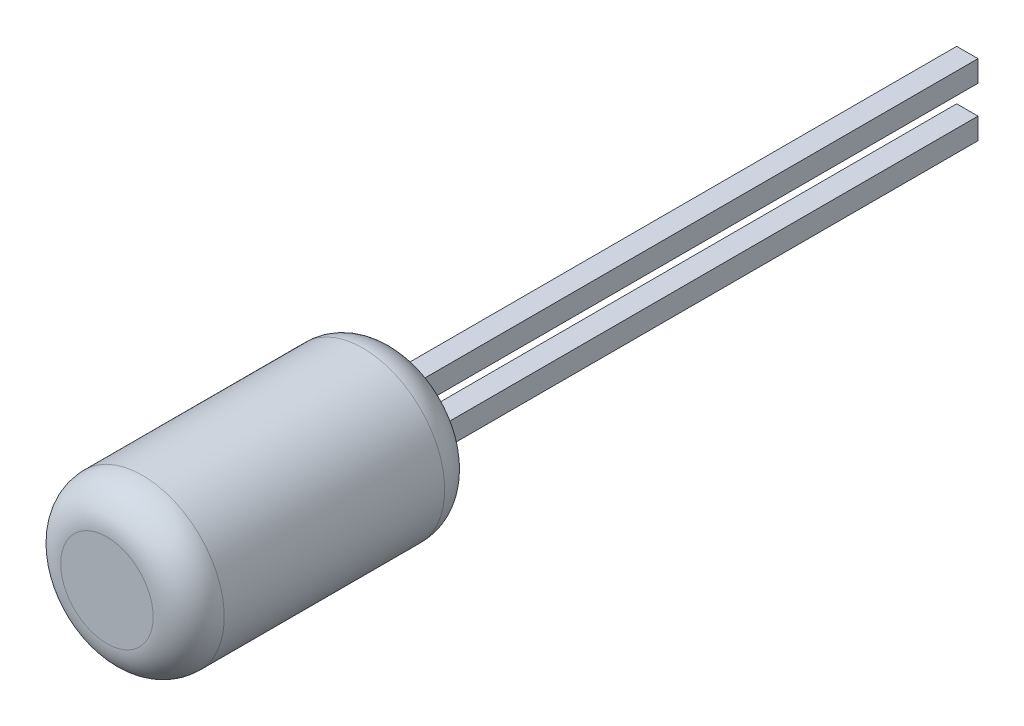
ISO-10303-21;
HEADER;
FILE_DESCRIPTION(('STEP AP214'),'2;1');
FILE_NAME('part.step','',(''),(''),'','','');
FILE_SCHEMA(('AUTOMOTIVE_DESIGN { 1 0 10303 214 1 1 1 1 }'));
ENDSEC;
DATA;
#1=APPLICATION_CONTEXT('core data for automotive mechanical design processes');
#2=APPLICATION_PROTOCOL_DEFINITION('international standard','automotive_design',2000,#1);
#3=PRODUCT_CONTEXT('',#1,'mechanical');
#4=PRODUCT('Part','Part','',(#3));
#5=PRODUCT_RELATED_PRODUCT_CATEGORY('part','',(#4));
#6=PRODUCT_DEFINITION_FORMATION('','',#4);
#7=PRODUCT_DEFINITION_CONTEXT('part definition',#1,'design');
#8=PRODUCT_DEFINITION('design','',#6,#7);
#9=PRODUCT_DEFINITION_SHAPE('','',#8);
#10=(LENGTH_UNIT() NAMED_UNIT(*) SI_UNIT(.MILLI.,.METRE.));
#11=(NAMED_UNIT(*) PLANE_ANGLE_UNIT() SI_UNIT($,.RADIAN.));
#12=(NAMED_UNIT(*) SI_UNIT($,.STERADIAN.) SOLID_ANGLE_UNIT());
#13=UNCERTAINTY_MEASURE_WITH_UNIT(LENGTH_MEASURE(1.E-05),#10,'distance_accuracy_value','');
#14=(GEOMETRIC_REPRESENTATION_CONTEXT(3) GLOBAL_UNCERTAINTY_ASSIGNED_CONTEXT((#13)) GLOBAL_UNIT_ASSIGNED_CONTEXT((#10,
#11,#12)) REPRESENTATION_CONTEXT('',''));
#15=CARTESIAN_POINT('',(0.,0.,0.));
#16=DIRECTION('',(0.,0.,1.));
#17=DIRECTION('',(1.,0.,0.));
#18=AXIS2_PLACEMENT_3D('',#15,#16,#17);
#19=CARTESIAN_POINT('',(0.,0.,0.));
#20=DIRECTION('',(0.,0.,1.));
#21=DIRECTION('',(1.,0.,0.));
#22=AXIS2_PLACEMENT_3D('',#19,#20,#21);
#23=PLANE('',#22);
#24=CARTESIAN_POINT('',(0.,0.,0.));
#25=DIRECTION('',(0.,0.,-1.));
#26=DIRECTION('',(-1.,0.,0.));
#27=AXIS2_PLACEMENT_3D('',#24,#25,#26);
#28=CIRCLE('',#27,0.65);
#29=CARTESIAN_POINT('',(-0.65,0.,0.));
#30=VERTEX_POINT('',#29);
#31=CARTESIAN_POINT('',(0.65,0.,0.));
#32=VERTEX_POINT('',#31);
#33=EDGE_CURVE('P0_E49',#30,#32,#28,.T.);
#34=ORIENTED_EDGE('',*,*,#33,.F.);
#35=CARTESIAN_POINT('',(0.,0.,0.));
#36=DIRECTION('',(0.,0.,-1.));
#37=DIRECTION('',(1.,0.,0.));
#38=AXIS2_PLACEMENT_3D('',#35,#36,#37);
#39=CIRCLE('',#38,0.65);
#40=EDGE_CURVE('P0_E45',#32,#30,#39,.T.);
#41=ORIENTED_EDGE('',*,*,#40,.F.);
#42=EDGE_LOOP('',(#34,#41));
#43=FACE_BOUND('',#42,.T.);
#44=ADVANCED_FACE('P0_F16',(#43),#23,.T.);
#45=CARTESIAN_POINT('',(0.,0.,-4.1));
#46=DIRECTION('',(0.,0.,-1.));
#47=DIRECTION('',(-1.,0.,0.));
#48=AXIS2_PLACEMENT_3D('',#45,#46,#47);
#49=PLANE('',#48);
#50=CARTESIAN_POINT('',(0.,0.,-4.1));
#51=DIRECTION('',(0.,0.,1.));
#52=DIRECTION('',(1.,0.,0.));
#53=AXIS2_PLACEMENT_3D('',#50,#51,#52);
#54=CIRCLE('',#53,0.65);
#55=CARTESIAN_POINT('',(0.65,0.,-4.1));
#56=VERTEX_POINT('',#55);
#57=CARTESIAN_POINT('',(-0.65,0.,-4.1));
#58=VERTEX_POINT('',#57);
#59=EDGE_CURVE('P0_E56',#56,#58,#54,.T.);
#60=ORIENTED_EDGE('',*,*,#59,.F.);
#61=CARTESIAN_POINT('',(0.,0.,-4.1));
#62=DIRECTION('',(0.,0.,1.));
#63=DIRECTION('',(-1.,0.,0.));
#64=AXIS2_PLACEMENT_3D('',#61,#62,#63);
#65=CIRCLE('',#64,0.65);
#66=EDGE_CURVE('P0_E36',#58,#56,#65,.T.);
#67=ORIENTED_EDGE('',*,*,#66,.F.);
#68=EDGE_LOOP('',(#60,#67));
#69=FACE_BOUND('',#68,.T.);
#70=ADVANCED_FACE('P0_F74',(#69),#49,.T.);
#71=CARTESIAN_POINT('',(0.,0.,-0.5));
#72=DIRECTION('',(0.,0.,1.));
#73=DIRECTION('',(1.,0.,0.));
#74=AXIS2_PLACEMENT_3D('',#71,#72,#73);
#75=TOROIDAL_SURFACE('',#74,0.65,0.5);
#76=ORIENTED_EDGE('',*,*,#40,.T.);
#77=ORIENTED_EDGE('',*,*,#33,.T.);
#78=EDGE_LOOP('',(#76,#77));
#79=FACE_BOUND('',#78,.T.);
#80=CARTESIAN_POINT('',(0.,0.,-0.5));
#81=DIRECTION('',(0.,0.,-1.));
#82=DIRECTION('',(-1.,0.,0.));
#83=AXIS2_PLACEMENT_3D('',#80,#81,#82);
#84=CIRCLE('',#83,1.15);
#85=CARTESIAN_POINT('',(-1.15,0.,-0.5));
#86=VERTEX_POINT('',#85);
#87=EDGE_CURVE('P0_E28',#86,#86,#84,.T.);
#88=ORIENTED_EDGE('',*,*,#87,.F.);
#89=EDGE_LOOP('',(#88));
#90=FACE_BOUND('',#89,.T.);
#91=ADVANCED_FACE('P0_F54',(#79,#90),#75,.T.);
#92=CARTESIAN_POINT('',(0.,0.,-3.6));
#93=DIRECTION('',(0.,0.,-1.));
#94=DIRECTION('',(-1.,0.,0.));
#95=AXIS2_PLACEMENT_3D('',#92,#93,#94);
#96=TOROIDAL_SURFACE('',#95,0.65,0.5);
#97=ORIENTED_EDGE('',*,*,#66,.T.);
#98=ORIENTED_EDGE('',*,*,#59,.T.);
#99=EDGE_LOOP('',(#97,#98));
#100=FACE_BOUND('',#99,.T.);
#101=CARTESIAN_POINT('',(0.,0.,-3.6));
#102=DIRECTION('',(0.,0.,-1.));
#103=DIRECTION('',(-1.,0.,0.));
#104=AXIS2_PLACEMENT_3D('',#101,#102,#103);
#105=CIRCLE('',#104,1.15);
#106=CARTESIAN_POINT('',(-1.15,0.,-3.6));
#107=VERTEX_POINT('',#106);
#108=EDGE_CURVE('P0_E11',#107,#107,#105,.F.);
#109=ORIENTED_EDGE('',*,*,#108,.F.);
#110=EDGE_LOOP('',(#109));
#111=FACE_BOUND('',#110,.T.);
#112=ADVANCED_FACE('P0_F73',(#100,#111),#96,.T.);
#113=CARTESIAN_POINT('',(0.,0.,0.));
#114=DIRECTION('',(0.,0.,-1.));
#115=DIRECTION('',(-1.,0.,0.));
#116=AXIS2_PLACEMENT_3D('',#113,#114,#115);
#117=CYLINDRICAL_SURFACE('',#116,1.15);
#118=ORIENTED_EDGE('',*,*,#108,.T.);
#119=EDGE_LOOP('',(#118));
#120=FACE_BOUND('',#119,.T.);
#121=ORIENTED_EDGE('',*,*,#87,.T.);
#122=EDGE_LOOP('',(#121));
#123=FACE_BOUND('',#122,.T.);
#124=ADVANCED_FACE('P0_F120',(#120,#123),#117,.T.);
#125=CLOSED_SHELL('',(#44,#70,#91,#112,#124));
#126=MANIFOLD_SOLID_BREP('P0_B1',#125);
#127=CARTESIAN_POINT('',(-0.15,-0.5,-3.1));
#128=DIRECTION('',(-1.,0.,0.));
#129=DIRECTION('',(0.,-1.,0.));
#130=AXIS2_PLACEMENT_3D('',#127,#128,#129);
#131=PLANE('',#130);
#132=DIRECTION('',(0.,0.,-1.));
#133=VECTOR('',#132,1.);
#134=CARTESIAN_POINT('',(-0.15,-0.5,-3.1));
#135=LINE('',#134,#133);
#136=CARTESIAN_POINT('',(-0.15,-0.5,-3.1));
#137=VERTEX_POINT('',#136);
#138=CARTESIAN_POINT('',(-0.15,-0.5,-12.1));
#139=VERTEX_POINT('',#138);
#140=EDGE_CURVE('P1_E60',#137,#139,#135,.T.);
#141=ORIENTED_EDGE('',*,*,#140,.F.);
#142=DIRECTION('',(0.,-1.,0.));
#143=VECTOR('',#142,1.);
#144=CARTESIAN_POINT('',(-0.15,-0.5,-3.1));
#145=LINE('',#144,#143);
#146=CARTESIAN_POINT('',(-0.15,-0.2,-3.1));
#147=VERTEX_POINT('',#146);
#148=EDGE_CURVE('P1_E19',#137,#147,#145,.F.);
#149=ORIENTED_EDGE('',*,*,#148,.T.);
#150=DIRECTION('',(0.,0.,1.));
#151=VECTOR('',#150,1.);
#152=CARTESIAN_POINT('',(-0.15,-0.2,-3.1));
#153=LINE('',#152,#151);
#154=CARTESIAN_POINT('',(-0.15,-0.2,-12.1));
#155=VERTEX_POINT('',#154);
#156=EDGE_CURVE('P1_E62',#155,#147,#153,.T.);
#157=ORIENTED_EDGE('',*,*,#156,.F.);
#158=DIRECTION('',(0.,1.,0.));
#159=VECTOR('',#158,1.);
#160=CARTESIAN_POINT('',(-0.15,0.,-12.1));
#161=LINE('',#160,#159);
#162=EDGE_CURVE('P1_E55',#155,#139,#161,.F.);
#163=ORIENTED_EDGE('',*,*,#162,.T.);
#164=EDGE_LOOP('',(#141,#149,#157,#163));
#165=FACE_BOUND('',#164,.T.);
#166=ADVANCED_FACE('P1_F16',(#165),#131,.T.);
#167=CARTESIAN_POINT('',(0.15,-0.5,-3.1));
#168=DIRECTION('',(0.,-1.,0.));
#169=DIRECTION('',(0.,0.,-1.));
#170=AXIS2_PLACEMENT_3D('',#167,#168,#169);
#171=PLANE('',#170);
#172=DIRECTION('',(0.,0.,-1.));
#173=VECTOR('',#172,1.);
#174=CARTESIAN_POINT('',(0.15,-0.5,-3.1));
#175=LINE('',#174,#173);
#176=CARTESIAN_POINT('',(0.15,-0.5,-3.1));
#177=VERTEX_POINT('',#176);
#178=CARTESIAN_POINT('',(0.15,-0.5,-12.1));
#179=VERTEX_POINT('',#178);
#180=EDGE_CURVE('P1_E82',#177,#179,#175,.T.);
#181=ORIENTED_EDGE('',*,*,#180,.F.);
#182=DIRECTION('',(1.,0.,0.));
#183=VECTOR('',#182,1.);
#184=CARTESIAN_POINT('',(0.,-0.5,-3.1));
#185=LINE('',#184,#183);
#186=EDGE_CURVE('P1_E70',#137,#177,#185,.T.);
#187=ORIENTED_EDGE('',*,*,#186,.F.);
#188=ORIENTED_EDGE('',*,*,#140,.T.);
#189=DIRECTION('',(1.,0.,0.));
#190=VECTOR('',#189,1.);
#191=CARTESIAN_POINT('',(0.,-0.5,-12.1));
#192=LINE('',#191,#190);
#193=EDGE_CURVE('P1_E64',#139,#179,#192,.T.);
#194=ORIENTED_EDGE('',*,*,#193,.T.);
#195=EDGE_LOOP('',(#181,#187,#188,#194));
#196=FACE_BOUND('',#195,.T.);
#197=ADVANCED_FACE('P1_F67',(#196),#171,.T.);
#198=CARTESIAN_POINT('',(0.,0.,-12.1));
#199=DIRECTION('',(0.,0.,1.));
#200=DIRECTION('',(1.,0.,0.));
#201=AXIS2_PLACEMENT_3D('',#198,#199,#200);
#202=PLANE('',#201);
#203=ORIENTED_EDGE('',*,*,#193,.F.);
#204=ORIENTED_EDGE('',*,*,#162,.F.);
#205=DIRECTION('',(1.,0.,0.));
#206=VECTOR('',#205,1.);
#207=CARTESIAN_POINT('',(0.15,-0.2,-12.1));
#208=LINE('',#207,#206);
#209=CARTESIAN_POINT('',(0.15,-0.2,-12.1));
#210=VERTEX_POINT('',#209);
#211=EDGE_CURVE('P1_E75',#210,#155,#208,.F.);
#212=ORIENTED_EDGE('',*,*,#211,.F.);
#213=DIRECTION('',(0.,1.,0.));
#214=VECTOR('',#213,1.);
#215=CARTESIAN_POINT('',(0.15,-0.5,-12.1));
#216=LINE('',#215,#214);
#217=EDGE_CURVE('P1_E73',#179,#210,#216,.T.);
#218=ORIENTED_EDGE('',*,*,#217,.F.);
#219=EDGE_LOOP('',(#203,#204,#212,#218));
#220=FACE_BOUND('',#219,.T.);
#221=ADVANCED_FACE('P1_F71',(#220),#202,.F.);
#222=CARTESIAN_POINT('',(0.15,-0.2,-3.1));
#223=DIRECTION('',(0.,1.,0.));
#224=DIRECTION('',(0.,0.,1.));
#225=AXIS2_PLACEMENT_3D('',#222,#223,#224);
#226=PLANE('',#225);
#227=ORIENTED_EDGE('',*,*,#156,.T.);
#228=DIRECTION('',(1.,0.,0.));
#229=VECTOR('',#228,1.);
#230=CARTESIAN_POINT('',(0.,-0.2,-3.1));
#231=LINE('',#230,#229);
#232=CARTESIAN_POINT('',(0.15,-0.2,-3.1));
#233=VERTEX_POINT('',#232);
#234=EDGE_CURVE('P1_E34',#233,#147,#231,.F.);
#235=ORIENTED_EDGE('',*,*,#234,.F.);
#236=DIRECTION('',(0.,0.,-1.));
#237=VECTOR('',#236,1.);
#238=CARTESIAN_POINT('',(0.15,-0.2,-3.1));
#239=LINE('',#238,#237);
#240=EDGE_CURVE('P1_E25',#210,#233,#239,.F.);
#241=ORIENTED_EDGE('',*,*,#240,.F.);
#242=ORIENTED_EDGE('',*,*,#211,.T.);
#243=EDGE_LOOP('',(#227,#235,#241,#242));
#244=FACE_BOUND('',#243,.T.);
#245=ADVANCED_FACE('P1_F88',(#244),#226,.T.);
#246=CARTESIAN_POINT('',(0.,0.,-3.1));
#247=DIRECTION('',(0.,0.,1.));
#248=DIRECTION('',(1.,0.,0.));
#249=AXIS2_PLACEMENT_3D('',#246,#247,#248);
#250=PLANE('',#249);
#251=ORIENTED_EDGE('',*,*,#148,.F.);
#252=ORIENTED_EDGE('',*,*,#186,.T.);
#253=DIRECTION('',(0.,1.,0.));
#254=VECTOR('',#253,1.);
#255=CARTESIAN_POINT('',(0.15,-0.5,-3.1));
#256=LINE('',#255,#254);
#257=EDGE_CURVE('P1_E11',#233,#177,#256,.F.);
#258=ORIENTED_EDGE('',*,*,#257,.F.);
#259=ORIENTED_EDGE('',*,*,#234,.T.);
#260=EDGE_LOOP('',(#251,#252,#258,#259));
#261=FACE_BOUND('',#260,.T.);
#262=ADVANCED_FACE('P1_F90',(#261),#250,.T.);
#263=CARTESIAN_POINT('',(0.15,-0.5,-3.1));
#264=DIRECTION('',(1.,0.,0.));
#265=DIRECTION('',(0.,0.,-1.));
#266=AXIS2_PLACEMENT_3D('',#263,#264,#265);
#267=PLANE('',#266);
#268=ORIENTED_EDGE('',*,*,#240,.T.);
#269=ORIENTED_EDGE('',*,*,#257,.T.);
#270=ORIENTED_EDGE('',*,*,#180,.T.);
#271=ORIENTED_EDGE('',*,*,#217,.T.);
#272=EDGE_LOOP('',(#268,#269,#270,#271));
#273=FACE_BOUND('',#272,.T.);
#274=ADVANCED_FACE('P1_F87',(#273),#267,.T.);
#275=CLOSED_SHELL('',(#166,#197,#221,#245,#262,#274));
#276=MANIFOLD_SOLID_BREP('P1_B1',#275);
#277=CARTESIAN_POINT('',(0.15,0.5,-3.1));
#278=DIRECTION('',(1.,0.,0.));
#279=DIRECTION('',(0.,0.,-1.));
#280=AXIS2_PLACEMENT_3D('',#277,#278,#279);
#281=PLANE('',#280);
#282=DIRECTION('',(0.,0.,1.));
#283=VECTOR('',#282,1.);
#284=CARTESIAN_POINT('',(0.15,0.5,-3.1));
#285=LINE('',#284,#283);
#286=CARTESIAN_POINT('',(0.15,0.5,-3.1));
#287=VERTEX_POINT('',#286);
#288=CARTESIAN_POINT('',(0.15,0.5,-12.1));
#289=VERTEX_POINT('',#288);
#290=EDGE_CURVE('P2_E60',#287,#289,#285,.F.);
#291=ORIENTED_EDGE('',*,*,#290,.F.);
#292=DIRECTION('',(0.,1.,0.));
#293=VECTOR('',#292,1.);
#294=CARTESIAN_POINT('',(0.15,0.5,-3.1));
#295=LINE('',#294,#293);
#296=CARTESIAN_POINT('',(0.15,0.2,-3.1));
#297=VERTEX_POINT('',#296);
#298=EDGE_CURVE('P2_E18',#287,#297,#295,.F.);
#299=ORIENTED_EDGE('',*,*,#298,.T.);
#300=DIRECTION('',(0.,0.,-1.));
#301=VECTOR('',#300,1.);
#302=CARTESIAN_POINT('',(0.15,0.2,-3.1));
#303=LINE('',#302,#301);
#304=CARTESIAN_POINT('',(0.15,0.2,-12.1));
#305=VERTEX_POINT('',#304);
#306=EDGE_CURVE('P2_E67',#305,#297,#303,.F.);
#307=ORIENTED_EDGE('',*,*,#306,.F.);
#308=DIRECTION('',(0.,1.,0.));
#309=VECTOR('',#308,1.);
#310=CARTESIAN_POINT('',(0.15,0.,-12.1));
#311=LINE('',#310,#309);
#312=EDGE_CURVE('P2_E54',#289,#305,#311,.F.);
#313=ORIENTED_EDGE('',*,*,#312,.F.);
#314=EDGE_LOOP('',(#291,#299,#307,#313));
#315=FACE_BOUND('',#314,.T.);
#316=ADVANCED_FACE('P2_F15',(#315),#281,.T.);
#317=CARTESIAN_POINT('',(0.15,0.5,-3.1));
#318=DIRECTION('',(0.,1.,0.));
#319=DIRECTION('',(0.,0.,1.));
#320=AXIS2_PLACEMENT_3D('',#317,#318,#319);
#321=PLANE('',#320);
#322=DIRECTION('',(0.,0.,1.));
#323=VECTOR('',#322,1.);
#324=CARTESIAN_POINT('',(-0.15,0.5,-3.1));
#325=LINE('',#324,#323);
#326=CARTESIAN_POINT('',(-0.15,0.5,-3.1));
#327=VERTEX_POINT('',#326);
#328=CARTESIAN_POINT('',(-0.15,0.5,-12.1));
#329=VERTEX_POINT('',#328);
#330=EDGE_CURVE('P2_E81',#327,#329,#325,.F.);
#331=ORIENTED_EDGE('',*,*,#330,.F.);
#332=DIRECTION('',(-1.,0.,0.));
#333=VECTOR('',#332,1.);
#334=CARTESIAN_POINT('',(0.,0.5,-3.1));
#335=LINE('',#334,#333);
#336=EDGE_CURVE('P2_E65',#327,#287,#335,.F.);
#337=ORIENTED_EDGE('',*,*,#336,.T.);
#338=ORIENTED_EDGE('',*,*,#290,.T.);
#339=DIRECTION('',(-1.,0.,0.));
#340=VECTOR('',#339,1.);
#341=CARTESIAN_POINT('',(0.,0.5,-12.1));
#342=LINE('',#341,#340);
#343=EDGE_CURVE('P2_E62',#329,#289,#342,.F.);
#344=ORIENTED_EDGE('',*,*,#343,.F.);
#345=EDGE_LOOP('',(#331,#337,#338,#344));
#346=FACE_BOUND('',#345,.T.);
#347=ADVANCED_FACE('P2_F61',(#346),#321,.T.);
#348=CARTESIAN_POINT('',(0.,0.,-12.1));
#349=DIRECTION('',(0.,0.,-1.));
#350=DIRECTION('',(-1.,0.,0.));
#351=AXIS2_PLACEMENT_3D('',#348,#349,#350);
#352=PLANE('',#351);
#353=ORIENTED_EDGE('',*,*,#312,.T.);
#354=DIRECTION('',(1.,0.,0.));
#355=VECTOR('',#354,1.);
#356=CARTESIAN_POINT('',(0.15,0.2,-12.1));
#357=LINE('',#356,#355);
#358=CARTESIAN_POINT('',(-0.15,0.2,-12.1));
#359=VERTEX_POINT('',#358);
#360=EDGE_CURVE('P2_E69',#359,#305,#357,.T.);
#361=ORIENTED_EDGE('',*,*,#360,.F.);
#362=DIRECTION('',(0.,-1.,0.));
#363=VECTOR('',#362,1.);
#364=CARTESIAN_POINT('',(-0.15,0.5,-12.1));
#365=LINE('',#364,#363);
#366=EDGE_CURVE('P2_E73',#329,#359,#365,.T.);
#367=ORIENTED_EDGE('',*,*,#366,.F.);
#368=ORIENTED_EDGE('',*,*,#343,.T.);
#369=EDGE_LOOP('',(#353,#361,#367,#368));
#370=FACE_BOUND('',#369,.T.);
#371=ADVANCED_FACE('P2_F71',(#370),#352,.T.);
#372=CARTESIAN_POINT('',(0.15,0.2,-3.1));
#373=DIRECTION('',(0.,-1.,0.));
#374=DIRECTION('',(0.,0.,-1.));
#375=AXIS2_PLACEMENT_3D('',#372,#373,#374);
#376=PLANE('',#375);
#377=ORIENTED_EDGE('',*,*,#306,.T.);
#378=DIRECTION('',(-1.,0.,0.));
#379=VECTOR('',#378,1.);
#380=CARTESIAN_POINT('',(0.,0.2,-3.1));
#381=LINE('',#380,#379);
#382=CARTESIAN_POINT('',(-0.15,0.2,-3.1));
#383=VERTEX_POINT('',#382);
#384=EDGE_CURVE('P2_E33',#297,#383,#381,.T.);
#385=ORIENTED_EDGE('',*,*,#384,.T.);
#386=DIRECTION('',(0.,0.,1.));
#387=VECTOR('',#386,1.);
#388=CARTESIAN_POINT('',(-0.15,0.2,-3.1));
#389=LINE('',#388,#387);
#390=EDGE_CURVE('P2_E24',#359,#383,#389,.T.);
#391=ORIENTED_EDGE('',*,*,#390,.F.);
#392=ORIENTED_EDGE('',*,*,#360,.T.);
#393=EDGE_LOOP('',(#377,#385,#391,#392));
#394=FACE_BOUND('',#393,.T.);
#395=ADVANCED_FACE('P2_F87',(#394),#376,.T.);
#396=CARTESIAN_POINT('',(0.,0.,-3.1));
#397=DIRECTION('',(0.,0.,-1.));
#398=DIRECTION('',(-1.,0.,0.));
#399=AXIS2_PLACEMENT_3D('',#396,#397,#398);
#400=PLANE('',#399);
#401=ORIENTED_EDGE('',*,*,#384,.F.);
#402=ORIENTED_EDGE('',*,*,#298,.F.);
#403=ORIENTED_EDGE('',*,*,#336,.F.);
#404=DIRECTION('',(0.,-1.,0.));
#405=VECTOR('',#404,1.);
#406=CARTESIAN_POINT('',(-0.15,0.5,-3.1));
#407=LINE('',#406,#405);
#408=EDGE_CURVE('P2_E10',#383,#327,#407,.F.);
#409=ORIENTED_EDGE('',*,*,#408,.F.);
#410=EDGE_LOOP('',(#401,#402,#403,#409));
#411=FACE_BOUND('',#410,.T.);
#412=ADVANCED_FACE('P2_F89',(#411),#400,.F.);
#413=CARTESIAN_POINT('',(-0.15,0.5,-3.1));
#414=DIRECTION('',(-1.,0.,0.));
#415=DIRECTION('',(0.,-1.,0.));
#416=AXIS2_PLACEMENT_3D('',#413,#414,#415);
#417=PLANE('',#416);
#418=ORIENTED_EDGE('',*,*,#390,.T.);
#419=ORIENTED_EDGE('',*,*,#408,.T.);
#420=ORIENTED_EDGE('',*,*,#330,.T.);
#421=ORIENTED_EDGE('',*,*,#366,.T.);
#422=EDGE_LOOP('',(#418,#419,#420,#421));
#423=FACE_BOUND('',#422,.T.);
#424=ADVANCED_FACE('P2_F86',(#423),#417,.T.);
#425=CLOSED_SHELL('',(#316,#347,#371,#395,#412,#424));
#426=MANIFOLD_SOLID_BREP('P2_B1',#425);
#427=ADVANCED_BREP_SHAPE_REPRESENTATION('',(#18,#126,#276,#426),#14);
#428=SHAPE_DEFINITION_REPRESENTATION(#9,#427);
ENDSEC;
END-ISO-10303-21;
